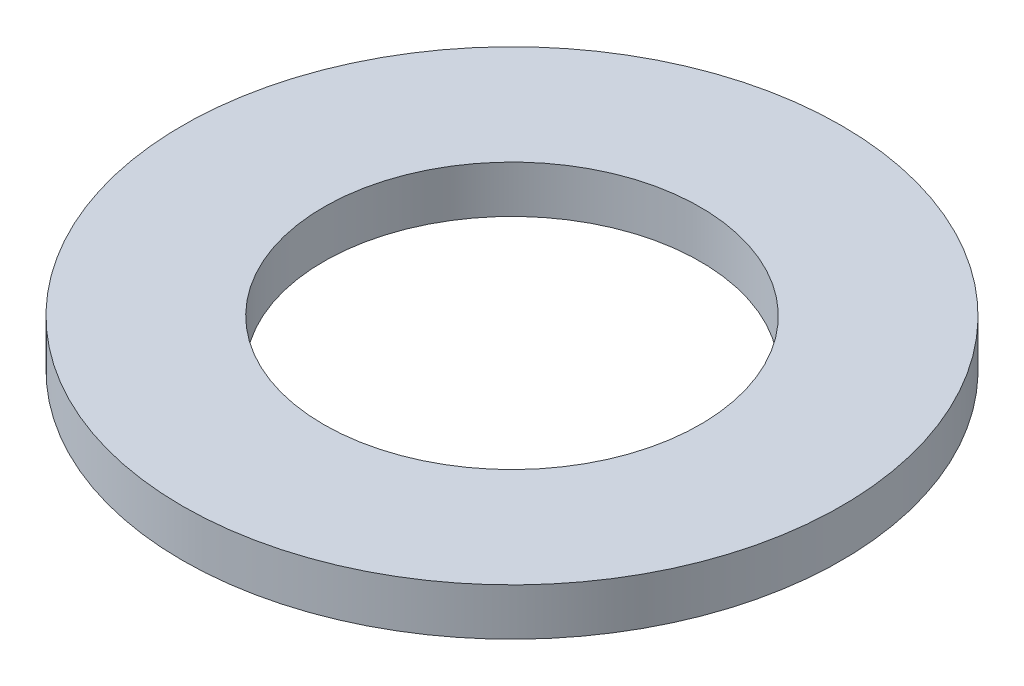
ISO-10303-21;
HEADER;
FILE_DESCRIPTION(('STEP AP214'),'2;1');
FILE_NAME('part.step','',(''),(''),'','','');
FILE_SCHEMA(('AUTOMOTIVE_DESIGN { 1 0 10303 214 1 1 1 1 }'));
ENDSEC;
DATA;
#1=APPLICATION_CONTEXT('core data for automotive mechanical design processes');
#2=APPLICATION_PROTOCOL_DEFINITION('international standard','automotive_design',2000,#1);
#3=PRODUCT_CONTEXT('',#1,'mechanical');
#4=PRODUCT('Part','Part','',(#3));
#5=PRODUCT_RELATED_PRODUCT_CATEGORY('part','',(#4));
#6=PRODUCT_DEFINITION_FORMATION('','',#4);
#7=PRODUCT_DEFINITION_CONTEXT('part definition',#1,'design');
#8=PRODUCT_DEFINITION('design','',#6,#7);
#9=PRODUCT_DEFINITION_SHAPE('','',#8);
#10=(LENGTH_UNIT() NAMED_UNIT(*) SI_UNIT(.MILLI.,.METRE.));
#11=(NAMED_UNIT(*) PLANE_ANGLE_UNIT() SI_UNIT($,.RADIAN.));
#12=(NAMED_UNIT(*) SI_UNIT($,.STERADIAN.) SOLID_ANGLE_UNIT());
#13=UNCERTAINTY_MEASURE_WITH_UNIT(LENGTH_MEASURE(1.E-05),#10,'distance_accuracy_value','');
#14=(GEOMETRIC_REPRESENTATION_CONTEXT(3) GLOBAL_UNCERTAINTY_ASSIGNED_CONTEXT((#13)) GLOBAL_UNIT_ASSIGNED_CONTEXT((#10,
#11,#12)) REPRESENTATION_CONTEXT('',''));
#15=CARTESIAN_POINT('',(0.,0.,0.));
#16=DIRECTION('',(0.,0.,1.));
#17=DIRECTION('',(1.,0.,0.));
#18=AXIS2_PLACEMENT_3D('',#15,#16,#17);
#19=CARTESIAN_POINT('',(0.,0.,0.));
#20=DIRECTION('',(0.,1.,0.));
#21=DIRECTION('',(1.,0.,0.));
#22=AXIS2_PLACEMENT_3D('',#19,#20,#21);
#23=PLANE('',#22);
#24=CARTESIAN_POINT('',(0.,0.,0.));
#25=DIRECTION('',(0.,1.,0.));
#26=DIRECTION('',(0.,0.,1.));
#27=AXIS2_PLACEMENT_3D('',#24,#25,#26);
#28=CIRCLE('',#27,4.);
#29=CARTESIAN_POINT('',(0.,0.,4.));
#30=VERTEX_POINT('',#29);
#31=EDGE_CURVE('E40',#30,#30,#28,.T.);
#32=ORIENTED_EDGE('',*,*,#31,.T.);
#33=EDGE_LOOP('',(#32));
#34=FACE_BOUND('',#33,.T.);
#35=CARTESIAN_POINT('',(0.,0.,0.));
#36=DIRECTION('',(0.,1.,0.));
#37=DIRECTION('',(0.,0.,1.));
#38=AXIS2_PLACEMENT_3D('',#35,#36,#37);
#39=CIRCLE('',#38,7.);
#40=CARTESIAN_POINT('',(0.,0.,7.));
#41=VERTEX_POINT('',#40);
#42=EDGE_CURVE('E10',#41,#41,#39,.T.);
#43=ORIENTED_EDGE('',*,*,#42,.F.);
#44=EDGE_LOOP('',(#43));
#45=FACE_BOUND('',#44,.T.);
#46=ADVANCED_FACE('F14',(#34,#45),#23,.F.);
#47=CARTESIAN_POINT('',(0.,1.,0.));
#48=DIRECTION('',(0.,1.,0.));
#49=DIRECTION('',(1.,0.,0.));
#50=AXIS2_PLACEMENT_3D('',#47,#48,#49);
#51=PLANE('',#50);
#52=CARTESIAN_POINT('',(0.,1.,0.));
#53=DIRECTION('',(0.,1.,0.));
#54=DIRECTION('',(0.,0.,1.));
#55=AXIS2_PLACEMENT_3D('',#52,#53,#54);
#56=CIRCLE('',#55,4.);
#57=CARTESIAN_POINT('',(0.,1.,4.));
#58=VERTEX_POINT('',#57);
#59=EDGE_CURVE('E28',#58,#58,#56,.T.);
#60=ORIENTED_EDGE('',*,*,#59,.F.);
#61=EDGE_LOOP('',(#60));
#62=FACE_BOUND('',#61,.T.);
#63=CARTESIAN_POINT('',(0.,1.,0.));
#64=DIRECTION('',(0.,1.,0.));
#65=DIRECTION('',(0.,0.,1.));
#66=AXIS2_PLACEMENT_3D('',#63,#64,#65);
#67=CIRCLE('',#66,7.);
#68=CARTESIAN_POINT('',(0.,1.,7.));
#69=VERTEX_POINT('',#68);
#70=EDGE_CURVE('E21',#69,#69,#67,.T.);
#71=ORIENTED_EDGE('',*,*,#70,.T.);
#72=EDGE_LOOP('',(#71));
#73=FACE_BOUND('',#72,.T.);
#74=ADVANCED_FACE('F60',(#62,#73),#51,.T.);
#75=CARTESIAN_POINT('',(0.,1.,0.));
#76=DIRECTION('',(0.,-1.,0.));
#77=DIRECTION('',(0.,0.,-1.));
#78=AXIS2_PLACEMENT_3D('',#75,#76,#77);
#79=CYLINDRICAL_SURFACE('',#78,7.);
#80=ORIENTED_EDGE('',*,*,#42,.T.);
#81=EDGE_LOOP('',(#80));
#82=FACE_BOUND('',#81,.T.);
#83=ORIENTED_EDGE('',*,*,#70,.F.);
#84=EDGE_LOOP('',(#83));
#85=FACE_BOUND('',#84,.T.);
#86=ADVANCED_FACE('F49',(#82,#85),#79,.T.);
#87=CARTESIAN_POINT('',(0.,0.,0.));
#88=DIRECTION('',(0.,1.,0.));
#89=DIRECTION('',(0.,0.,1.));
#90=AXIS2_PLACEMENT_3D('',#87,#88,#89);
#91=CYLINDRICAL_SURFACE('',#90,4.);
#92=ORIENTED_EDGE('',*,*,#59,.T.);
#93=EDGE_LOOP('',(#92));
#94=FACE_BOUND('',#93,.T.);
#95=ORIENTED_EDGE('',*,*,#31,.F.);
#96=EDGE_LOOP('',(#95));
#97=FACE_BOUND('',#96,.T.);
#98=ADVANCED_FACE('F48',(#94,#97),#91,.F.);
#99=CLOSED_SHELL('',(#46,#74,#86,#98));
#100=MANIFOLD_SOLID_BREP('B1',#99);
#101=ADVANCED_BREP_SHAPE_REPRESENTATION('',(#18,#100),#14);
#102=SHAPE_DEFINITION_REPRESENTATION(#9,#101);
ENDSEC;
END-ISO-10303-21;
